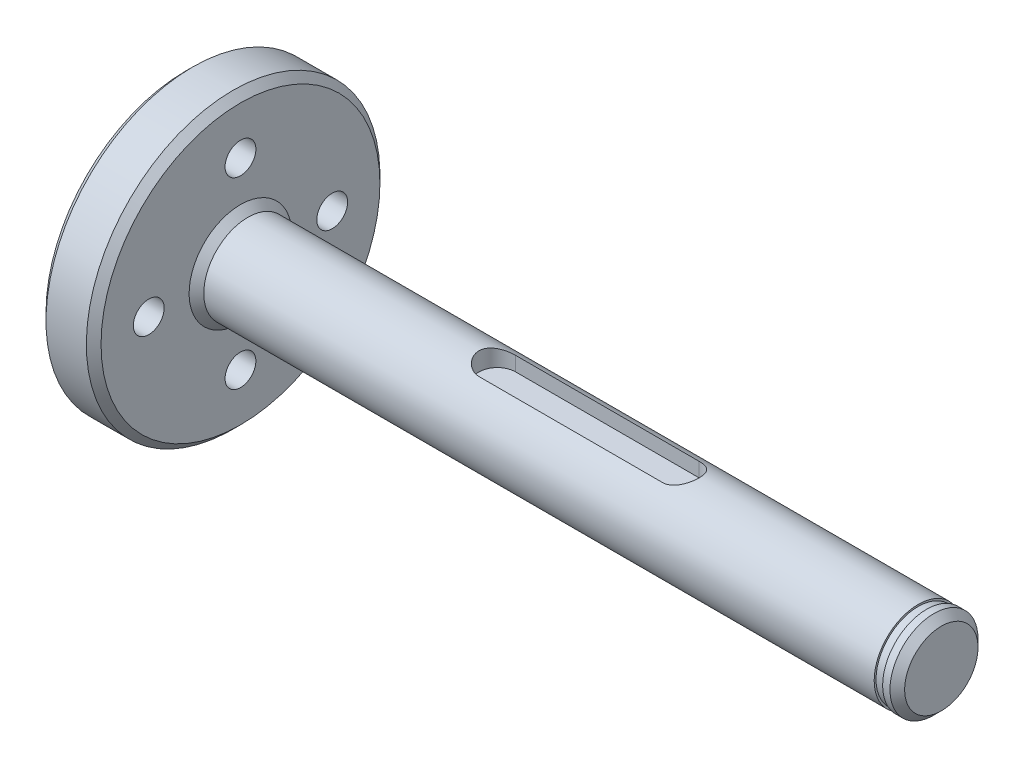
ISO-10303-21;
HEADER;
FILE_DESCRIPTION(('STEP AP214'),'2;1');
FILE_NAME('part.step','',(''),(''),'','','');
FILE_SCHEMA(('AUTOMOTIVE_DESIGN { 1 0 10303 214 1 1 1 1 }'));
ENDSEC;
DATA;
#1=APPLICATION_CONTEXT('core data for automotive mechanical design processes');
#2=APPLICATION_PROTOCOL_DEFINITION('international standard','automotive_design',2000,#1);
#3=PRODUCT_CONTEXT('',#1,'mechanical');
#4=PRODUCT('Part','Part','',(#3));
#5=PRODUCT_RELATED_PRODUCT_CATEGORY('part','',(#4));
#6=PRODUCT_DEFINITION_FORMATION('','',#4);
#7=PRODUCT_DEFINITION_CONTEXT('part definition',#1,'design');
#8=PRODUCT_DEFINITION('design','',#6,#7);
#9=PRODUCT_DEFINITION_SHAPE('','',#8);
#10=(LENGTH_UNIT() NAMED_UNIT(*) SI_UNIT(.MILLI.,.METRE.));
#11=(NAMED_UNIT(*) PLANE_ANGLE_UNIT() SI_UNIT($,.RADIAN.));
#12=(NAMED_UNIT(*) SI_UNIT($,.STERADIAN.) SOLID_ANGLE_UNIT());
#13=UNCERTAINTY_MEASURE_WITH_UNIT(LENGTH_MEASURE(1.E-05),#10,'distance_accuracy_value','');
#14=(GEOMETRIC_REPRESENTATION_CONTEXT(3) GLOBAL_UNCERTAINTY_ASSIGNED_CONTEXT((#13)) GLOBAL_UNIT_ASSIGNED_CONTEXT((#10,
#11,#12)) REPRESENTATION_CONTEXT('',''));
#15=CARTESIAN_POINT('',(0.,0.,0.));
#16=DIRECTION('',(0.,0.,1.));
#17=DIRECTION('',(1.,0.,0.));
#18=AXIS2_PLACEMENT_3D('',#15,#16,#17);
#19=CARTESIAN_POINT('',(103.,0.,0.));
#20=DIRECTION('',(1.,0.,0.));
#21=DIRECTION('',(0.,1.,0.));
#22=AXIS2_PLACEMENT_3D('',#19,#20,#21);
#23=CYLINDRICAL_SURFACE('',#22,5.99999999999998);
#24=CARTESIAN_POINT('',(8.50000000000005,0.,0.));
#25=DIRECTION('',(1.,0.,0.));
#26=DIRECTION('',(0.,1.,0.));
#27=AXIS2_PLACEMENT_3D('',#24,#25,#26);
#28=CIRCLE('',#27,5.99999999999998);
#29=CARTESIAN_POINT('',(8.50000000000005,5.99999999999998,0.));
#30=VERTEX_POINT('',#29);
#31=EDGE_CURVE('E147',#30,#30,#28,.T.);
#32=ORIENTED_EDGE('',*,*,#31,.T.);
#33=EDGE_LOOP('',(#32));
#34=FACE_BOUND('',#33,.T.);
#35=CARTESIAN_POINT('',(67.5,5.45435605731785,2.5));
#36=CARTESIAN_POINT('',(67.566990421397,5.45434143672739,2.50001024965806));
#37=CARTESIAN_POINT('',(67.6339728576071,5.45558986423114,2.49730766074456));
#38=CARTESIAN_POINT('',(67.767391217606,5.46050344433191,2.48655699342007));
#39=CARTESIAN_POINT('',(67.8338273558978,5.46416759753226,2.47851112553775));
#40=CARTESIAN_POINT('',(67.9654018598714,5.47378318611765,2.45719882557102));
#41=CARTESIAN_POINT('',(68.0305445048847,5.47972494833871,2.44395446621823));
#42=CARTESIAN_POINT('',(68.1593476505706,5.49369035165667,2.41239773056354));
#43=CARTESIAN_POINT('',(68.2230080494491,5.50171413528083,2.39408500729503));
#44=CARTESIAN_POINT('',(68.4109704766892,5.52852216859035,2.33184505253746));
#45=CARTESIAN_POINT('',(68.5325349409199,5.55006534458071,2.28056973965756));
#46=CARTESIAN_POINT('',(68.765394969978,5.59805026874339,2.16009667726576));
#47=CARTESIAN_POINT('',(68.8766796624162,5.62449711638193,2.09088024017802));
#48=CARTESIAN_POINT('',(69.0926555180297,5.68111739532849,1.93194216605246));
#49=CARTESIAN_POINT('',(69.1966314637585,5.71141645652257,1.84129131772597));
#50=CARTESIAN_POINT('',(69.3884169369691,5.77129106659511,1.64402473251641));
#51=CARTESIAN_POINT('',(69.4762230019235,5.80086645933831,1.53740558511416));
#52=CARTESIAN_POINT('',(69.6368988289762,5.85751079611204,1.30552662419109));
#53=CARTESIAN_POINT('',(69.7089534877025,5.88441492036275,1.17965801419142));
#54=CARTESIAN_POINT('',(69.8305523948046,5.93113050419021,0.916263349803661));
#55=CARTESIAN_POINT('',(69.8801067434128,5.95094514533805,0.778742558960754));
#56=CARTESIAN_POINT('',(69.9526785710471,5.98035028996094,0.503538212911769));
#57=CARTESIAN_POINT('',(69.9769429460133,5.99041924152297,0.366235636683354));
#58=CARTESIAN_POINT('',(70.002275267891,6.00093656296526,0.0891608856613089));
#59=CARTESIAN_POINT('',(70.0033522066188,6.00138866214752,-0.0506103107853682));
#60=CARTESIAN_POINT('',(69.9829313516378,5.99290254661357,-0.319586702683723));
#61=CARTESIAN_POINT('',(69.9628034512649,5.98453414521296,-0.448917245472142));
#62=CARTESIAN_POINT('',(69.9028930910878,5.96013005449445,-0.702167963543969));
#63=CARTESIAN_POINT('',(69.8631095260154,5.94409393401055,-0.826087834150436));
#64=CARTESIAN_POINT('',(69.7645442163381,5.90559715444488,-1.06727556823007));
#65=CARTESIAN_POINT('',(69.7054818206956,5.8830421901553,-1.18441306332021));
#66=CARTESIAN_POINT('',(69.5703092180309,5.83371457161592,-1.40742238732224));
#67=CARTESIAN_POINT('',(69.4941928006955,5.80694038196896,-1.51329009151026));
#68=CARTESIAN_POINT('',(69.3208409664576,5.74963576527151,-1.71867537807254));
#69=CARTESIAN_POINT('',(69.2224958287417,5.71897359653012,-1.81722082953265));
#70=CARTESIAN_POINT('',(69.0105893535752,5.658760791831,-1.99685313522822));
#71=CARTESIAN_POINT('',(68.8970203460054,5.62921072584972,-2.07793113494235));
#72=CARTESIAN_POINT('',(68.6531453498455,5.57361619012467,-2.22284514508404));
#73=CARTESIAN_POINT('',(68.5224071265261,5.54772171984213,-2.28601504206341));
#74=CARTESIAN_POINT('',(68.2508546265431,5.50417661447928,-2.38897619183128));
#75=CARTESIAN_POINT('',(68.1100594530023,5.48651080537514,-2.4288105117282));
#76=CARTESIAN_POINT('',(67.8898491565922,5.46773287951055,-2.47065526537902));
#77=CARTESIAN_POINT('',(67.8123689332134,5.46274303006063,-2.48164099212926));
#78=CARTESIAN_POINT('',(67.6566098186605,5.45604541462646,-2.49631631258703));
#79=CARTESIAN_POINT('',(67.5783312227394,5.45433647659976,-2.50000851178052));
#80=CARTESIAN_POINT('',(67.5,5.45435605731785,-2.5));
#81=B_SPLINE_CURVE_WITH_KNOTS('',3,(#35,#36,#37,#38,#39,#40,#41,#42,#43,#44,#45,#46,#47,#48,#49,
#50,#51,#52,#53,#54,#55,#56,#57,#58,#59,#60,#61,#62,#63,#64,#65,#66,#67,#68,#69,#70,#71,#72,#73,
#74,#75,#76,#77,#78,#79,#80),.UNSPECIFIED.,.F.,.F.,(4,2,2,2,2,2,2,2,2,2,2,2,2,2,2,2,2,2,2,2,2,2,
4),(0.,0.200891876435005,0.401700695097976,0.601665948391959,0.801644894158595,1.20075599352943,
1.6002844916061,2.02212344548654,2.44405262481497,2.88432120276327,3.32439195134773,
3.74155898035476,4.15856423395471,4.5501908444364,4.94183947919071,5.33946474085078,
5.73723503589979,6.16301556467704,6.58901142297274,7.02923147484728,7.46863649546479,
7.70350874445824,7.93829707423866),.UNSPECIFIED.);
#82=CARTESIAN_POINT('',(67.5,5.45435605731785,2.5));
#83=VERTEX_POINT('',#82);
#84=CARTESIAN_POINT('',(67.5,5.45435605731785,-2.5));
#85=VERTEX_POINT('',#84);
#86=EDGE_CURVE('E168',#83,#85,#81,.T.);
#87=ORIENTED_EDGE('',*,*,#86,.F.);
#88=DIRECTION('',(1.,0.,0.));
#89=VECTOR('',#88,1.);
#90=CARTESIAN_POINT('',(103.,5.45435605731785,2.5));
#91=LINE('',#90,#89);
#92=CARTESIAN_POINT('',(42.5,5.45435605731785,2.5));
#93=VERTEX_POINT('',#92);
#94=EDGE_CURVE('E11',#93,#83,#91,.T.);
#95=ORIENTED_EDGE('',*,*,#94,.F.);
#96=CARTESIAN_POINT('',(42.5,5.45435605731785,-2.5));
#97=CARTESIAN_POINT('',(42.433009578603,5.45434143672739,-2.50001024965806));
#98=CARTESIAN_POINT('',(42.3660271423929,5.45558986423113,-2.49730766074456));
#99=CARTESIAN_POINT('',(42.232608782394,5.4605034443319,-2.48655699342007));
#100=CARTESIAN_POINT('',(42.1661726441022,5.46416759753226,-2.47851112553775));
#101=CARTESIAN_POINT('',(42.0345981401286,5.47378318611765,-2.45719882557102));
#102=CARTESIAN_POINT('',(41.9694554951153,5.4797249483387,-2.44395446621823));
#103=CARTESIAN_POINT('',(41.8406523494294,5.49369035165666,-2.41239773056354));
#104=CARTESIAN_POINT('',(41.7769919505508,5.50171413528083,-2.39408500729503));
#105=CARTESIAN_POINT('',(41.5890295233108,5.52852216859034,-2.33184505253746));
#106=CARTESIAN_POINT('',(41.4674650590801,5.55006534458071,-2.28056973965757));
#107=CARTESIAN_POINT('',(41.234605030022,5.59805026874339,-2.16009667726577));
#108=CARTESIAN_POINT('',(41.1233203375838,5.62449711638192,-2.09088024017803));
#109=CARTESIAN_POINT('',(40.9073444819703,5.68111739532848,-1.93194216605247));
#110=CARTESIAN_POINT('',(40.8033685362415,5.71141645652257,-1.84129131772597));
#111=CARTESIAN_POINT('',(40.6115830630309,5.7712910665951,-1.64402473251641));
#112=CARTESIAN_POINT('',(40.5237769980765,5.8008664593383,-1.53740558511416));
#113=CARTESIAN_POINT('',(40.3631011710238,5.85751079611203,-1.3055266241911));
#114=CARTESIAN_POINT('',(40.2910465122974,5.88441492036274,-1.17965801419142));
#115=CARTESIAN_POINT('',(40.1694476051954,5.93113050419021,-0.916263349803663));
#116=CARTESIAN_POINT('',(40.1198932565872,5.95094514533804,-0.778742558960756));
#117=CARTESIAN_POINT('',(40.0473214289529,5.98035028996093,-0.503538212911769));
#118=CARTESIAN_POINT('',(40.0230570539867,5.99041924152297,-0.366235636683356));
#119=CARTESIAN_POINT('',(39.997724732109,6.00093656296526,-0.089160885661311));
#120=CARTESIAN_POINT('',(39.9966477933812,6.00138866214752,0.0506103107853667));
#121=CARTESIAN_POINT('',(40.0170686483622,5.99290254661356,0.319586702683722));
#122=CARTESIAN_POINT('',(40.0371965487351,5.98453414521296,0.448917245472141));
#123=CARTESIAN_POINT('',(40.0971069089122,5.96013005449444,0.702167963543968));
#124=CARTESIAN_POINT('',(40.1368904739846,5.94409393401054,0.826087834150436));
#125=CARTESIAN_POINT('',(40.2354557836619,5.90559715444488,1.06727556823007));
#126=CARTESIAN_POINT('',(40.2945181793044,5.8830421901553,1.1844130633202));
#127=CARTESIAN_POINT('',(40.4296907819691,5.83371457161592,1.40742238732223));
#128=CARTESIAN_POINT('',(40.5058071993045,5.80694038196896,1.51329009151026));
#129=CARTESIAN_POINT('',(40.6791590335425,5.74963576527151,1.71867537807254));
#130=CARTESIAN_POINT('',(40.7775041712583,5.71897359653012,1.81722082953265));
#131=CARTESIAN_POINT('',(40.9894106464249,5.658760791831,1.99685313522822));
#132=CARTESIAN_POINT('',(41.1029796539946,5.62921072584972,2.07793113494236));
#133=CARTESIAN_POINT('',(41.3468546501545,5.57361619012466,2.22284514508404));
#134=CARTESIAN_POINT('',(41.4775928734739,5.54772171984213,2.28601504206341));
#135=CARTESIAN_POINT('',(41.7491453734569,5.50417661447928,2.38897619183128));
#136=CARTESIAN_POINT('',(41.8899405469978,5.48651080537513,2.4288105117282));
#137=CARTESIAN_POINT('',(42.1101508434078,5.46773287951054,2.47065526537902));
#138=CARTESIAN_POINT('',(42.1876310667866,5.46274303006063,2.48164099212926));
#139=CARTESIAN_POINT('',(42.3433901813395,5.45604541462646,2.49631631258703));
#140=CARTESIAN_POINT('',(42.4216687772607,5.45433647659976,2.50000851178052));
#141=CARTESIAN_POINT('',(42.5,5.45435605731784,2.5));
#142=B_SPLINE_CURVE_WITH_KNOTS('',3,(#96,#97,#98,#99,#100,#101,#102,#103,#104,#105,#106,#107,
#108,#109,#110,#111,#112,#113,#114,#115,#116,#117,#118,#119,#120,#121,#122,#123,#124,#125,#126,
#127,#128,#129,#130,#131,#132,#133,#134,#135,#136,#137,#138,#139,#140,#141),.UNSPECIFIED.,.F.,
.F.,(4,2,2,2,2,2,2,2,2,2,2,2,2,2,2,2,2,2,2,2,2,2,4),(0.,0.200891876435005,0.401700695097962,
0.601665948391966,0.801644894158596,1.20075599352941,1.6002844916061,2.02212344548654,
2.44405262481497,2.88432120276327,3.32439195134773,3.74155898035476,4.15856423395471,
4.5501908444364,4.94183947919071,5.33946474085077,5.73723503589979,6.16301556467703,
6.58901142297275,7.02923147484727,7.46863649546479,7.70350874445824,7.93829707423865),.UNSPECIFIED.);
#143=CARTESIAN_POINT('',(42.5,5.45435605731785,-2.5));
#144=VERTEX_POINT('',#143);
#145=EDGE_CURVE('E54',#144,#93,#142,.T.);
#146=ORIENTED_EDGE('',*,*,#145,.F.);
#147=DIRECTION('',(1.,0.,0.));
#148=VECTOR('',#147,1.);
#149=CARTESIAN_POINT('',(103.,5.45435605731785,-2.5));
#150=LINE('',#149,#148);
#151=EDGE_CURVE('E176',#85,#144,#150,.F.);
#152=ORIENTED_EDGE('',*,*,#151,.F.);
#153=EDGE_LOOP('',(#87,#95,#146,#152));
#154=FACE_BOUND('',#153,.T.);
#155=CARTESIAN_POINT('',(99.85,0.,0.));
#156=DIRECTION('',(-1.,0.,0.));
#157=DIRECTION('',(0.,0.,1.));
#158=AXIS2_PLACEMENT_3D('',#155,#156,#157);
#159=CIRCLE('',#158,5.99999999999998);
#160=CARTESIAN_POINT('',(99.85,0.,5.99999999999998));
#161=VERTEX_POINT('',#160);
#162=EDGE_CURVE('E207',#161,#161,#159,.T.);
#163=ORIENTED_EDGE('',*,*,#162,.T.);
#164=EDGE_LOOP('',(#163));
#165=FACE_BOUND('',#164,.T.);
#166=ADVANCED_FACE('F45',(#34,#154,#165),#23,.T.);
#167=CARTESIAN_POINT('',(0.,0.,0.));
#168=DIRECTION('',(-1.,0.,0.));
#169=DIRECTION('',(0.,-1.,0.));
#170=AXIS2_PLACEMENT_3D('',#167,#168,#169);
#171=PLANE('',#170);
#172=CARTESIAN_POINT('',(0.,12.5,0.));
#173=DIRECTION('',(-1.,0.,0.));
#174=DIRECTION('',(0.,0.,1.));
#175=AXIS2_PLACEMENT_3D('',#172,#173,#174);
#176=CIRCLE('',#175,2.09999999999999);
#177=CARTESIAN_POINT('',(0.,12.5,2.09999999999999));
#178=VERTEX_POINT('',#177);
#179=EDGE_CURVE('E116',#178,#178,#176,.T.);
#180=ORIENTED_EDGE('',*,*,#179,.F.);
#181=EDGE_LOOP('',(#180));
#182=FACE_BOUND('',#181,.T.);
#183=CARTESIAN_POINT('',(0.,3.52975155131649E-13,12.5000000000004));
#184=DIRECTION('',(-1.,0.,0.));
#185=DIRECTION('',(0.,0.,1.));
#186=AXIS2_PLACEMENT_3D('',#183,#184,#185);
#187=CIRCLE('',#186,2.09999999999999);
#188=CARTESIAN_POINT('',(0.,3.52975155131649E-13,14.6000000000003));
#189=VERTEX_POINT('',#188);
#190=EDGE_CURVE('E126',#189,#189,#187,.T.);
#191=ORIENTED_EDGE('',*,*,#190,.F.);
#192=EDGE_LOOP('',(#191));
#193=FACE_BOUND('',#192,.T.);
#194=CARTESIAN_POINT('',(0.,-12.5,7.05950310263298E-13));
#195=DIRECTION('',(-1.,0.,0.));
#196=DIRECTION('',(0.,0.,1.));
#197=AXIS2_PLACEMENT_3D('',#194,#195,#196);
#198=CIRCLE('',#197,2.09999999999999);
#199=CARTESIAN_POINT('',(0.,-12.5,2.10000000000069));
#200=VERTEX_POINT('',#199);
#201=EDGE_CURVE('E132',#200,#200,#198,.T.);
#202=ORIENTED_EDGE('',*,*,#201,.F.);
#203=EDGE_LOOP('',(#202));
#204=FACE_BOUND('',#203,.T.);
#205=CARTESIAN_POINT('',(0.,-3.51444346632715E-13,-12.4999999999996));
#206=DIRECTION('',(-1.,0.,0.));
#207=DIRECTION('',(0.,0.,1.));
#208=AXIS2_PLACEMENT_3D('',#205,#206,#207);
#209=CIRCLE('',#208,2.09999999999999);
#210=CARTESIAN_POINT('',(0.,-3.51444346632715E-13,-10.3999999999997));
#211=VERTEX_POINT('',#210);
#212=EDGE_CURVE('E138',#211,#211,#209,.T.);
#213=ORIENTED_EDGE('',*,*,#212,.F.);
#214=EDGE_LOOP('',(#213));
#215=FACE_BOUND('',#214,.T.);
#216=CARTESIAN_POINT('',(0.,0.,0.));
#217=DIRECTION('',(-1.,0.,0.));
#218=DIRECTION('',(0.,-1.,0.));
#219=AXIS2_PLACEMENT_3D('',#216,#217,#218);
#220=CIRCLE('',#219,19.);
#221=CARTESIAN_POINT('',(0.,-19.,0.));
#222=VERTEX_POINT('',#221);
#223=EDGE_CURVE('E165',#222,#222,#220,.T.);
#224=ORIENTED_EDGE('',*,*,#223,.T.);
#225=EDGE_LOOP('',(#224));
#226=FACE_BOUND('',#225,.T.);
#227=ADVANCED_FACE('F202',(#182,#193,#204,#215,#226),#171,.T.);
#228=CARTESIAN_POINT('',(103.,0.,0.));
#229=DIRECTION('',(1.,0.,0.));
#230=DIRECTION('',(0.,1.,0.));
#231=AXIS2_PLACEMENT_3D('',#228,#229,#230);
#232=CYLINDRICAL_SURFACE('',#231,20.);
#233=CARTESIAN_POINT('',(1.00000000000004,0.,0.));
#234=DIRECTION('',(-1.,0.,0.));
#235=DIRECTION('',(0.,-1.,0.));
#236=AXIS2_PLACEMENT_3D('',#233,#234,#235);
#237=CIRCLE('',#236,20.);
#238=CARTESIAN_POINT('',(1.00000000000005,-20.,0.));
#239=VERTEX_POINT('',#238);
#240=EDGE_CURVE('E162',#239,#239,#237,.F.);
#241=ORIENTED_EDGE('',*,*,#240,.T.);
#242=EDGE_LOOP('',(#241));
#243=FACE_BOUND('',#242,.T.);
#244=CARTESIAN_POINT('',(6.50000000000003,0.,0.));
#245=DIRECTION('',(1.,0.,0.));
#246=DIRECTION('',(0.,1.,0.));
#247=AXIS2_PLACEMENT_3D('',#244,#245,#246);
#248=CIRCLE('',#247,20.);
#249=CARTESIAN_POINT('',(6.50000000000003,20.,0.));
#250=VERTEX_POINT('',#249);
#251=EDGE_CURVE('E159',#250,#250,#248,.F.);
#252=ORIENTED_EDGE('',*,*,#251,.T.);
#253=EDGE_LOOP('',(#252));
#254=FACE_BOUND('',#253,.T.);
#255=ADVANCED_FACE('F284',(#243,#254),#232,.T.);
#256=CARTESIAN_POINT('',(7.5,20.,0.));
#257=DIRECTION('',(1.,0.,0.));
#258=DIRECTION('',(0.,1.,0.));
#259=AXIS2_PLACEMENT_3D('',#256,#257,#258);
#260=PLANE('',#259);
#261=CARTESIAN_POINT('',(7.5,12.5,0.));
#262=DIRECTION('',(1.,0.,0.));
#263=DIRECTION('',(0.,1.,0.));
#264=AXIS2_PLACEMENT_3D('',#261,#262,#263);
#265=CIRCLE('',#264,2.09999999999998);
#266=CARTESIAN_POINT('',(7.5,14.6,0.));
#267=VERTEX_POINT('',#266);
#268=EDGE_CURVE('E123',#267,#267,#265,.T.);
#269=ORIENTED_EDGE('',*,*,#268,.F.);
#270=EDGE_LOOP('',(#269));
#271=FACE_BOUND('',#270,.T.);
#272=CARTESIAN_POINT('',(7.5,3.52975155131649E-13,12.5000000000004));
#273=DIRECTION('',(1.,0.,0.));
#274=DIRECTION('',(0.,1.,0.));
#275=AXIS2_PLACEMENT_3D('',#272,#273,#274);
#276=CIRCLE('',#275,2.09999999999998);
#277=CARTESIAN_POINT('',(7.5,2.10000000000033,12.5000000000004));
#278=VERTEX_POINT('',#277);
#279=EDGE_CURVE('E129',#278,#278,#276,.T.);
#280=ORIENTED_EDGE('',*,*,#279,.F.);
#281=EDGE_LOOP('',(#280));
#282=FACE_BOUND('',#281,.T.);
#283=CARTESIAN_POINT('',(7.5,-12.5,7.05950310263298E-13));
#284=DIRECTION('',(1.,0.,0.));
#285=DIRECTION('',(0.,1.,0.));
#286=AXIS2_PLACEMENT_3D('',#283,#284,#285);
#287=CIRCLE('',#286,2.09999999999998);
#288=CARTESIAN_POINT('',(7.5,-10.4,7.05950310263298E-13));
#289=VERTEX_POINT('',#288);
#290=EDGE_CURVE('E135',#289,#289,#287,.T.);
#291=ORIENTED_EDGE('',*,*,#290,.F.);
#292=EDGE_LOOP('',(#291));
#293=FACE_BOUND('',#292,.T.);
#294=CARTESIAN_POINT('',(7.5,-3.51444346632715E-13,-12.4999999999996));
#295=DIRECTION('',(1.,0.,0.));
#296=DIRECTION('',(0.,1.,0.));
#297=AXIS2_PLACEMENT_3D('',#294,#295,#296);
#298=CIRCLE('',#297,2.09999999999998);
#299=CARTESIAN_POINT('',(7.5,2.09999999999963,-12.4999999999996));
#300=VERTEX_POINT('',#299);
#301=EDGE_CURVE('E141',#300,#300,#298,.T.);
#302=ORIENTED_EDGE('',*,*,#301,.F.);
#303=EDGE_LOOP('',(#302));
#304=FACE_BOUND('',#303,.T.);
#305=CARTESIAN_POINT('',(7.5,0.,0.));
#306=DIRECTION('',(1.,0.,0.));
#307=DIRECTION('',(0.,1.,0.));
#308=AXIS2_PLACEMENT_3D('',#305,#306,#307);
#309=CIRCLE('',#308,7.00000000000001);
#310=CARTESIAN_POINT('',(7.5,7.00000000000001,0.));
#311=VERTEX_POINT('',#310);
#312=EDGE_CURVE('E153',#311,#311,#309,.F.);
#313=ORIENTED_EDGE('',*,*,#312,.T.);
#314=EDGE_LOOP('',(#313));
#315=FACE_BOUND('',#314,.T.);
#316=CARTESIAN_POINT('',(7.5,0.,0.));
#317=DIRECTION('',(1.,0.,0.));
#318=DIRECTION('',(0.,1.,0.));
#319=AXIS2_PLACEMENT_3D('',#316,#317,#318);
#320=CIRCLE('',#319,19.);
#321=CARTESIAN_POINT('',(7.5,19.,0.));
#322=VERTEX_POINT('',#321);
#323=EDGE_CURVE('E150',#322,#322,#320,.T.);
#324=ORIENTED_EDGE('',*,*,#323,.T.);
#325=EDGE_LOOP('',(#324));
#326=FACE_BOUND('',#325,.T.);
#327=ADVANCED_FACE('F292',(#271,#282,#293,#304,#315,#326),#260,.T.);
#328=CARTESIAN_POINT('',(8.50000000000005,0.,0.));
#329=DIRECTION('',(-1.,0.,0.));
#330=DIRECTION('',(0.,-1.,0.));
#331=AXIS2_PLACEMENT_3D('',#328,#329,#330);
#332=CONICAL_SURFACE('',#331,5.99999999999998,0.785398163397438);
#333=ORIENTED_EDGE('',*,*,#312,.F.);
#334=EDGE_LOOP('',(#333));
#335=FACE_BOUND('',#334,.T.);
#336=ORIENTED_EDGE('',*,*,#31,.F.);
#337=EDGE_LOOP('',(#336));
#338=FACE_BOUND('',#337,.T.);
#339=ADVANCED_FACE('F288',(#335,#338),#332,.T.);
#340=CARTESIAN_POINT('',(1.00000000000004,0.,0.));
#341=DIRECTION('',(1.,0.,0.));
#342=DIRECTION('',(0.,1.,0.));
#343=AXIS2_PLACEMENT_3D('',#340,#341,#342);
#344=CONICAL_SURFACE('',#343,20.,0.785398163397443);
#345=ORIENTED_EDGE('',*,*,#223,.F.);
#346=EDGE_LOOP('',(#345));
#347=FACE_BOUND('',#346,.T.);
#348=ORIENTED_EDGE('',*,*,#240,.F.);
#349=EDGE_LOOP('',(#348));
#350=FACE_BOUND('',#349,.T.);
#351=ADVANCED_FACE('F291',(#347,#350),#344,.T.);
#352=CARTESIAN_POINT('',(7.49999999999999,0.,0.));
#353=DIRECTION('',(-1.,0.,0.));
#354=DIRECTION('',(0.,-1.,0.));
#355=AXIS2_PLACEMENT_3D('',#352,#353,#354);
#356=CONICAL_SURFACE('',#355,19.,0.785398163397448);
#357=ORIENTED_EDGE('',*,*,#251,.F.);
#358=EDGE_LOOP('',(#357));
#359=FACE_BOUND('',#358,.T.);
#360=ORIENTED_EDGE('',*,*,#323,.F.);
#361=EDGE_LOOP('',(#360));
#362=FACE_BOUND('',#361,.T.);
#363=ADVANCED_FACE('F48',(#359,#362),#356,.T.);
#364=CARTESIAN_POINT('',(0.,-3.51444346632715E-13,-12.4999999999996));
#365=DIRECTION('',(-1.,0.,0.));
#366=DIRECTION('',(0.,0.,1.));
#367=AXIS2_PLACEMENT_3D('',#364,#365,#366);
#368=CYLINDRICAL_SURFACE('',#367,2.09999999999998);
#369=ORIENTED_EDGE('',*,*,#301,.T.);
#370=EDGE_LOOP('',(#369));
#371=FACE_BOUND('',#370,.T.);
#372=ORIENTED_EDGE('',*,*,#212,.T.);
#373=EDGE_LOOP('',(#372));
#374=FACE_BOUND('',#373,.T.);
#375=ADVANCED_FACE('F310',(#371,#374),#368,.F.);
#376=CARTESIAN_POINT('',(0.,-12.5,7.05950310263298E-13));
#377=DIRECTION('',(-1.,0.,0.));
#378=DIRECTION('',(0.,0.,1.));
#379=AXIS2_PLACEMENT_3D('',#376,#377,#378);
#380=CYLINDRICAL_SURFACE('',#379,2.09999999999998);
#381=ORIENTED_EDGE('',*,*,#290,.T.);
#382=EDGE_LOOP('',(#381));
#383=FACE_BOUND('',#382,.T.);
#384=ORIENTED_EDGE('',*,*,#201,.T.);
#385=EDGE_LOOP('',(#384));
#386=FACE_BOUND('',#385,.T.);
#387=ADVANCED_FACE('F318',(#383,#386),#380,.F.);
#388=CARTESIAN_POINT('',(0.,3.52975155131649E-13,12.5000000000004));
#389=DIRECTION('',(-1.,0.,0.));
#390=DIRECTION('',(0.,0.,1.));
#391=AXIS2_PLACEMENT_3D('',#388,#389,#390);
#392=CYLINDRICAL_SURFACE('',#391,2.09999999999998);
#393=ORIENTED_EDGE('',*,*,#279,.T.);
#394=EDGE_LOOP('',(#393));
#395=FACE_BOUND('',#394,.T.);
#396=ORIENTED_EDGE('',*,*,#190,.T.);
#397=EDGE_LOOP('',(#396));
#398=FACE_BOUND('',#397,.T.);
#399=ADVANCED_FACE('F327',(#395,#398),#392,.F.);
#400=CARTESIAN_POINT('',(0.,12.5,0.));
#401=DIRECTION('',(-1.,0.,0.));
#402=DIRECTION('',(0.,0.,1.));
#403=AXIS2_PLACEMENT_3D('',#400,#401,#402);
#404=CYLINDRICAL_SURFACE('',#403,2.09999999999998);
#405=ORIENTED_EDGE('',*,*,#268,.T.);
#406=EDGE_LOOP('',(#405));
#407=FACE_BOUND('',#406,.T.);
#408=ORIENTED_EDGE('',*,*,#179,.T.);
#409=EDGE_LOOP('',(#408));
#410=FACE_BOUND('',#409,.T.);
#411=ADVANCED_FACE('F193',(#407,#410),#404,.F.);
#412=CARTESIAN_POINT('',(42.5,3.49999999999998,0.));
#413=DIRECTION('',(0.,1.,0.));
#414=DIRECTION('',(-1.,0.,0.));
#415=AXIS2_PLACEMENT_3D('',#412,#413,#414);
#416=CYLINDRICAL_SURFACE('',#415,2.5);
#417=DIRECTION('',(0.,1.,0.));
#418=VECTOR('',#417,1.);
#419=CARTESIAN_POINT('',(42.5,3.49999999999998,-2.5));
#420=LINE('',#419,#418);
#421=CARTESIAN_POINT('',(42.5,3.49999999999998,-2.5));
#422=VERTEX_POINT('',#421);
#423=EDGE_CURVE('E114',#422,#144,#420,.T.);
#424=ORIENTED_EDGE('',*,*,#423,.T.);
#425=ORIENTED_EDGE('',*,*,#145,.T.);
#426=DIRECTION('',(0.,1.,0.));
#427=VECTOR('',#426,1.);
#428=CARTESIAN_POINT('',(42.5,3.49999999999998,2.5));
#429=LINE('',#428,#427);
#430=CARTESIAN_POINT('',(42.5,3.49999999999998,2.5));
#431=VERTEX_POINT('',#430);
#432=EDGE_CURVE('E60',#431,#93,#429,.T.);
#433=ORIENTED_EDGE('',*,*,#432,.F.);
#434=CARTESIAN_POINT('',(42.5,3.49999999999998,0.));
#435=DIRECTION('',(0.,1.,0.));
#436=DIRECTION('',(-1.,0.,0.));
#437=AXIS2_PLACEMENT_3D('',#434,#435,#436);
#438=CIRCLE('',#437,2.5);
#439=EDGE_CURVE('E89',#422,#431,#438,.T.);
#440=ORIENTED_EDGE('',*,*,#439,.F.);
#441=EDGE_LOOP('',(#424,#425,#433,#440));
#442=FACE_BOUND('',#441,.T.);
#443=ADVANCED_FACE('F87',(#442),#416,.F.);
#444=CARTESIAN_POINT('',(42.5,3.49999999999998,-2.5));
#445=DIRECTION('',(0.,0.,-1.));
#446=DIRECTION('',(-1.,0.,0.));
#447=AXIS2_PLACEMENT_3D('',#444,#445,#446);
#448=PLANE('',#447);
#449=ORIENTED_EDGE('',*,*,#151,.T.);
#450=ORIENTED_EDGE('',*,*,#423,.F.);
#451=DIRECTION('',(-1.,0.,0.));
#452=VECTOR('',#451,1.);
#453=CARTESIAN_POINT('',(42.5,3.49999999999998,-2.5));
#454=LINE('',#453,#452);
#455=CARTESIAN_POINT('',(67.5,3.49999999999998,-2.5));
#456=VERTEX_POINT('',#455);
#457=EDGE_CURVE('E92',#456,#422,#454,.T.);
#458=ORIENTED_EDGE('',*,*,#457,.F.);
#459=DIRECTION('',(0.,1.,0.));
#460=VECTOR('',#459,1.);
#461=CARTESIAN_POINT('',(67.5,3.49999999999998,-2.5));
#462=LINE('',#461,#460);
#463=EDGE_CURVE('E117',#456,#85,#462,.T.);
#464=ORIENTED_EDGE('',*,*,#463,.T.);
#465=EDGE_LOOP('',(#449,#450,#458,#464));
#466=FACE_BOUND('',#465,.T.);
#467=ADVANCED_FACE('F185',(#466),#448,.F.);
#468=CARTESIAN_POINT('',(67.5,3.49999999999998,0.));
#469=DIRECTION('',(0.,1.,0.));
#470=DIRECTION('',(-1.,0.,0.));
#471=AXIS2_PLACEMENT_3D('',#468,#469,#470);
#472=CYLINDRICAL_SURFACE('',#471,2.5);
#473=DIRECTION('',(0.,1.,0.));
#474=VECTOR('',#473,1.);
#475=CARTESIAN_POINT('',(67.5,3.49999999999998,2.5));
#476=LINE('',#475,#474);
#477=CARTESIAN_POINT('',(67.5,3.49999999999998,2.5));
#478=VERTEX_POINT('',#477);
#479=EDGE_CURVE('E91',#478,#83,#476,.T.);
#480=ORIENTED_EDGE('',*,*,#479,.T.);
#481=ORIENTED_EDGE('',*,*,#86,.T.);
#482=ORIENTED_EDGE('',*,*,#463,.F.);
#483=CARTESIAN_POINT('',(67.5,3.49999999999998,0.));
#484=DIRECTION('',(0.,1.,0.));
#485=DIRECTION('',(-1.,0.,0.));
#486=AXIS2_PLACEMENT_3D('',#483,#484,#485);
#487=CIRCLE('',#486,2.5);
#488=EDGE_CURVE('E101',#478,#456,#487,.T.);
#489=ORIENTED_EDGE('',*,*,#488,.F.);
#490=EDGE_LOOP('',(#480,#481,#482,#489));
#491=FACE_BOUND('',#490,.T.);
#492=ADVANCED_FACE('F180',(#491),#472,.F.);
#493=CARTESIAN_POINT('',(42.5,3.49999999999998,2.5));
#494=DIRECTION('',(0.,0.,1.));
#495=DIRECTION('',(1.,0.,0.));
#496=AXIS2_PLACEMENT_3D('',#493,#494,#495);
#497=PLANE('',#496);
#498=ORIENTED_EDGE('',*,*,#94,.T.);
#499=ORIENTED_EDGE('',*,*,#479,.F.);
#500=DIRECTION('',(1.,0.,0.));
#501=VECTOR('',#500,1.);
#502=CARTESIAN_POINT('',(42.5,3.49999999999998,2.5));
#503=LINE('',#502,#501);
#504=EDGE_CURVE('E95',#431,#478,#503,.T.);
#505=ORIENTED_EDGE('',*,*,#504,.F.);
#506=ORIENTED_EDGE('',*,*,#432,.T.);
#507=EDGE_LOOP('',(#498,#499,#505,#506));
#508=FACE_BOUND('',#507,.T.);
#509=ADVANCED_FACE('F96',(#508),#497,.F.);
#510=CARTESIAN_POINT('',(42.5,3.49999999999998,0.));
#511=DIRECTION('',(0.,1.,0.));
#512=DIRECTION('',(-1.,0.,0.));
#513=AXIS2_PLACEMENT_3D('',#510,#511,#512);
#514=PLANE('',#513);
#515=ORIENTED_EDGE('',*,*,#439,.T.);
#516=ORIENTED_EDGE('',*,*,#504,.T.);
#517=ORIENTED_EDGE('',*,*,#488,.T.);
#518=ORIENTED_EDGE('',*,*,#457,.T.);
#519=EDGE_LOOP('',(#515,#516,#517,#518));
#520=FACE_BOUND('',#519,.T.);
#521=ADVANCED_FACE('F103',(#520),#514,.T.);
#522=CARTESIAN_POINT('',(99.85,0.,-5.99999999999998));
#523=DIRECTION('',(1.,0.,0.));
#524=DIRECTION('',(0.,0.,-1.));
#525=AXIS2_PLACEMENT_3D('',#522,#523,#524);
#526=PLANE('',#525);
#527=CARTESIAN_POINT('',(99.85,0.,0.));
#528=DIRECTION('',(-1.,0.,0.));
#529=DIRECTION('',(0.,0.,1.));
#530=AXIS2_PLACEMENT_3D('',#527,#528,#529);
#531=CIRCLE('',#530,5.75);
#532=CARTESIAN_POINT('',(99.85,0.,5.75));
#533=VERTEX_POINT('',#532);
#534=EDGE_CURVE('E105',#533,#533,#531,.T.);
#535=ORIENTED_EDGE('',*,*,#534,.T.);
#536=EDGE_LOOP('',(#535));
#537=FACE_BOUND('',#536,.T.);
#538=ORIENTED_EDGE('',*,*,#162,.F.);
#539=EDGE_LOOP('',(#538));
#540=FACE_BOUND('',#539,.T.);
#541=ADVANCED_FACE('F230',(#537,#540),#526,.T.);
#542=CARTESIAN_POINT('',(0.,0.,0.));
#543=DIRECTION('',(-1.,0.,0.));
#544=DIRECTION('',(0.,0.,1.));
#545=AXIS2_PLACEMENT_3D('',#542,#543,#544);
#546=CYLINDRICAL_SURFACE('',#545,5.75);
#547=CARTESIAN_POINT('',(101.,0.,0.));
#548=DIRECTION('',(-1.,0.,0.));
#549=DIRECTION('',(0.,0.,1.));
#550=AXIS2_PLACEMENT_3D('',#547,#548,#549);
#551=CIRCLE('',#550,5.75);
#552=CARTESIAN_POINT('',(101.,0.,5.75));
#553=VERTEX_POINT('',#552);
#554=EDGE_CURVE('E108',#553,#553,#551,.T.);
#555=ORIENTED_EDGE('',*,*,#554,.T.);
#556=EDGE_LOOP('',(#555));
#557=FACE_BOUND('',#556,.T.);
#558=ORIENTED_EDGE('',*,*,#534,.F.);
#559=EDGE_LOOP('',(#558));
#560=FACE_BOUND('',#559,.T.);
#561=ADVANCED_FACE('F216',(#557,#560),#546,.T.);
#562=CARTESIAN_POINT('',(101.,0.,-5.99999999999998));
#563=DIRECTION('',(-1.,0.,0.));
#564=DIRECTION('',(0.,0.,1.));
#565=AXIS2_PLACEMENT_3D('',#562,#563,#564);
#566=PLANE('',#565);
#567=CARTESIAN_POINT('',(101.,0.,0.));
#568=DIRECTION('',(-1.,0.,0.));
#569=DIRECTION('',(0.,0.,1.));
#570=AXIS2_PLACEMENT_3D('',#567,#568,#569);
#571=CIRCLE('',#570,5.99999999999998);
#572=CARTESIAN_POINT('',(101.,0.,5.99999999999998));
#573=VERTEX_POINT('',#572);
#574=EDGE_CURVE('E209',#573,#573,#571,.T.);
#575=ORIENTED_EDGE('',*,*,#574,.T.);
#576=EDGE_LOOP('',(#575));
#577=FACE_BOUND('',#576,.T.);
#578=ORIENTED_EDGE('',*,*,#554,.F.);
#579=EDGE_LOOP('',(#578));
#580=FACE_BOUND('',#579,.T.);
#581=ADVANCED_FACE('F219',(#577,#580),#566,.T.);
#582=CARTESIAN_POINT('',(103.,5.99999999999999,0.));
#583=DIRECTION('',(1.,0.,0.));
#584=DIRECTION('',(0.,1.,0.));
#585=AXIS2_PLACEMENT_3D('',#582,#583,#584);
#586=PLANE('',#585);
#587=CARTESIAN_POINT('',(103.,0.,0.));
#588=DIRECTION('',(1.,0.,0.));
#589=DIRECTION('',(0.,1.,0.));
#590=AXIS2_PLACEMENT_3D('',#587,#588,#589);
#591=CIRCLE('',#590,4.99999999999998);
#592=CARTESIAN_POINT('',(103.,4.99999999999999,0.));
#593=VERTEX_POINT('',#592);
#594=EDGE_CURVE('E156',#593,#593,#591,.T.);
#595=ORIENTED_EDGE('',*,*,#594,.T.);
#596=EDGE_LOOP('',(#595));
#597=FACE_BOUND('',#596,.T.);
#598=ADVANCED_FACE('F221',(#597),#586,.T.);
#599=CARTESIAN_POINT('',(103.,0.,0.));
#600=DIRECTION('',(-1.,0.,0.));
#601=DIRECTION('',(0.,-1.,0.));
#602=AXIS2_PLACEMENT_3D('',#599,#600,#601);
#603=CONICAL_SURFACE('',#602,4.99999999999998,0.785398163397445);
#604=CARTESIAN_POINT('',(102.,0.,0.));
#605=DIRECTION('',(1.,0.,0.));
#606=DIRECTION('',(0.,1.,0.));
#607=AXIS2_PLACEMENT_3D('',#604,#605,#606);
#608=CIRCLE('',#607,5.99999999999998);
#609=CARTESIAN_POINT('',(102.,6.,0.));
#610=VERTEX_POINT('',#609);
#611=EDGE_CURVE('E144',#610,#610,#608,.F.);
#612=ORIENTED_EDGE('',*,*,#611,.F.);
#613=EDGE_LOOP('',(#612));
#614=FACE_BOUND('',#613,.T.);
#615=ORIENTED_EDGE('',*,*,#594,.F.);
#616=EDGE_LOOP('',(#615));
#617=FACE_BOUND('',#616,.T.);
#618=ADVANCED_FACE('F228',(#614,#617),#603,.T.);
#619=ORIENTED_EDGE('',*,*,#611,.T.);
#620=EDGE_LOOP('',(#619));
#621=FACE_BOUND('',#620,.T.);
#622=ORIENTED_EDGE('',*,*,#574,.F.);
#623=EDGE_LOOP('',(#622));
#624=FACE_BOUND('',#623,.T.);
#625=ADVANCED_FACE('F204',(#621,#624),#23,.T.);
#626=CLOSED_SHELL('',(#166,#227,#255,#327,#339,#351,#363,#375,#387,#399,#411,#443,#467,#492,
#509,#521,#541,#561,#581,#598,#618,#625));
#627=MANIFOLD_SOLID_BREP('B2',#626);
#628=ADVANCED_BREP_SHAPE_REPRESENTATION('',(#18,#627),#14);
#629=SHAPE_DEFINITION_REPRESENTATION(#9,#628);
ENDSEC;
END-ISO-10303-21;
